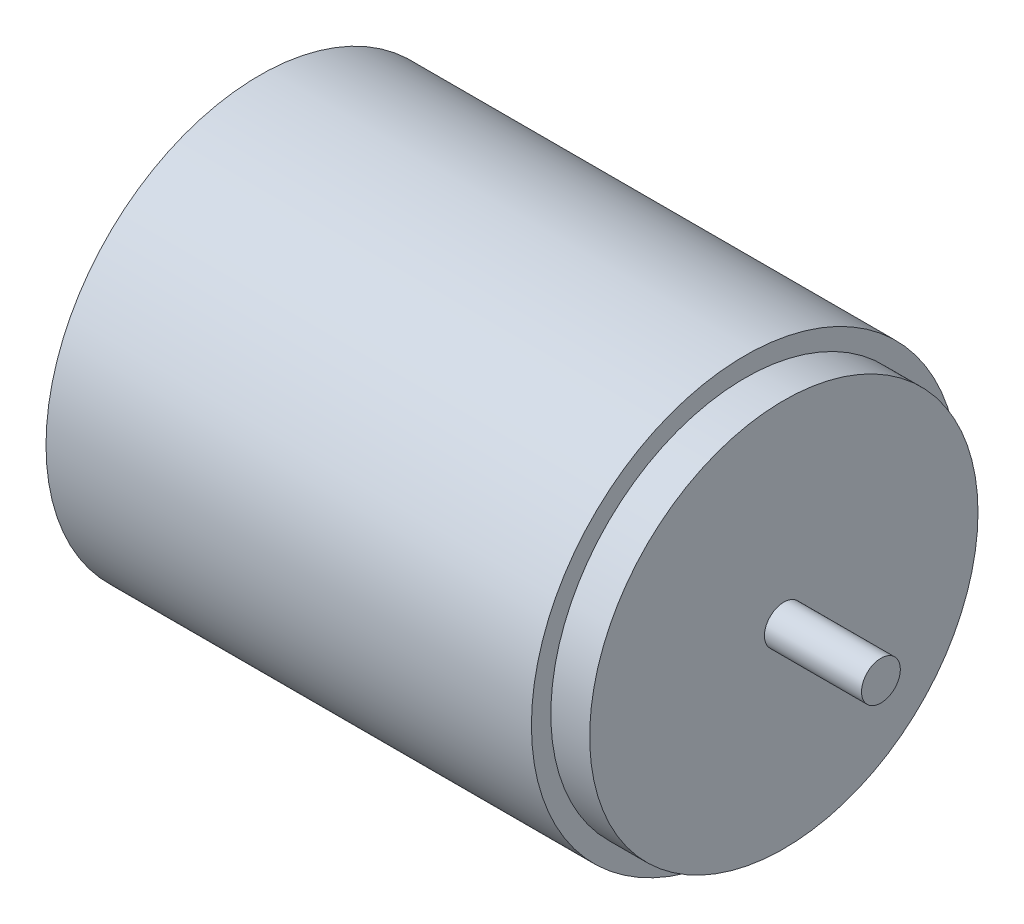
ISO-10303-21;
HEADER;
FILE_DESCRIPTION(('STEP AP214'),'2;1');
FILE_NAME('part.step','',(''),(''),'','','');
FILE_SCHEMA(('AUTOMOTIVE_DESIGN { 1 0 10303 214 1 1 1 1 }'));
ENDSEC;
DATA;
#1=APPLICATION_CONTEXT('core data for automotive mechanical design processes');
#2=APPLICATION_PROTOCOL_DEFINITION('international standard','automotive_design',2000,#1);
#3=PRODUCT_CONTEXT('',#1,'mechanical');
#4=PRODUCT('Part','Part','',(#3));
#5=PRODUCT_RELATED_PRODUCT_CATEGORY('part','',(#4));
#6=PRODUCT_DEFINITION_FORMATION('','',#4);
#7=PRODUCT_DEFINITION_CONTEXT('part definition',#1,'design');
#8=PRODUCT_DEFINITION('design','',#6,#7);
#9=PRODUCT_DEFINITION_SHAPE('','',#8);
#10=(LENGTH_UNIT() NAMED_UNIT(*) SI_UNIT(.MILLI.,.METRE.));
#11=(NAMED_UNIT(*) PLANE_ANGLE_UNIT() SI_UNIT($,.RADIAN.));
#12=(NAMED_UNIT(*) SI_UNIT($,.STERADIAN.) SOLID_ANGLE_UNIT());
#13=UNCERTAINTY_MEASURE_WITH_UNIT(LENGTH_MEASURE(1.E-05),#10,'distance_accuracy_value','');
#14=(GEOMETRIC_REPRESENTATION_CONTEXT(3) GLOBAL_UNCERTAINTY_ASSIGNED_CONTEXT((#13)) GLOBAL_UNIT_ASSIGNED_CONTEXT((#10,
#11,#12)) REPRESENTATION_CONTEXT('',''));
#15=CARTESIAN_POINT('',(0.,0.,0.));
#16=DIRECTION('',(0.,0.,1.));
#17=DIRECTION('',(1.,0.,0.));
#18=AXIS2_PLACEMENT_3D('',#15,#16,#17);
#19=CARTESIAN_POINT('',(27.,0.,0.));
#20=DIRECTION('',(1.,0.,0.));
#21=DIRECTION('',(0.,0.,-1.));
#22=AXIS2_PLACEMENT_3D('',#19,#20,#21);
#23=PLANE('',#22);
#24=CARTESIAN_POINT('',(27.,0.,0.));
#25=DIRECTION('',(1.,0.,0.));
#26=DIRECTION('',(0.,0.,-1.));
#27=AXIS2_PLACEMENT_3D('',#24,#25,#26);
#28=CIRCLE('',#27,10.);
#29=CARTESIAN_POINT('',(27.,0.,-10.));
#30=VERTEX_POINT('',#29);
#31=EDGE_CURVE('E43',#30,#30,#28,.T.);
#32=ORIENTED_EDGE('',*,*,#31,.T.);
#33=EDGE_LOOP('',(#32));
#34=FACE_BOUND('',#33,.T.);
#35=CARTESIAN_POINT('',(27.,0.,0.));
#36=DIRECTION('',(1.,0.,0.));
#37=DIRECTION('',(0.,0.,-1.));
#38=AXIS2_PLACEMENT_3D('',#35,#36,#37);
#39=CIRCLE('',#38,1.);
#40=CARTESIAN_POINT('',(27.,0.,-1.));
#41=VERTEX_POINT('',#40);
#42=EDGE_CURVE('E51',#41,#41,#39,.T.);
#43=ORIENTED_EDGE('',*,*,#42,.F.);
#44=EDGE_LOOP('',(#43));
#45=FACE_BOUND('',#44,.T.);
#46=ADVANCED_FACE('F32',(#34,#45),#23,.T.);
#47=CARTESIAN_POINT('',(25.,0.,0.));
#48=DIRECTION('',(1.,0.,0.));
#49=DIRECTION('',(0.,0.,-1.));
#50=AXIS2_PLACEMENT_3D('',#47,#48,#49);
#51=PLANE('',#50);
#52=CARTESIAN_POINT('',(25.,0.,0.));
#53=DIRECTION('',(1.,0.,0.));
#54=DIRECTION('',(0.,0.,-1.));
#55=AXIS2_PLACEMENT_3D('',#52,#53,#54);
#56=CIRCLE('',#55,11.);
#57=CARTESIAN_POINT('',(25.,0.,-11.));
#58=VERTEX_POINT('',#57);
#59=EDGE_CURVE('E10',#58,#58,#56,.T.);
#60=ORIENTED_EDGE('',*,*,#59,.T.);
#61=EDGE_LOOP('',(#60));
#62=FACE_BOUND('',#61,.T.);
#63=CARTESIAN_POINT('',(25.,0.,0.));
#64=DIRECTION('',(1.,0.,0.));
#65=DIRECTION('',(0.,0.,-1.));
#66=AXIS2_PLACEMENT_3D('',#63,#64,#65);
#67=CIRCLE('',#66,10.);
#68=CARTESIAN_POINT('',(25.,0.,-10.));
#69=VERTEX_POINT('',#68);
#70=EDGE_CURVE('E45',#69,#69,#67,.T.);
#71=ORIENTED_EDGE('',*,*,#70,.F.);
#72=EDGE_LOOP('',(#71));
#73=FACE_BOUND('',#72,.T.);
#74=ADVANCED_FACE('F67',(#62,#73),#51,.T.);
#75=CARTESIAN_POINT('',(25.,0.,0.));
#76=DIRECTION('',(-1.,0.,0.));
#77=DIRECTION('',(0.,0.,1.));
#78=AXIS2_PLACEMENT_3D('',#75,#76,#77);
#79=CYLINDRICAL_SURFACE('',#78,11.);
#80=ORIENTED_EDGE('',*,*,#59,.F.);
#81=EDGE_LOOP('',(#80));
#82=FACE_BOUND('',#81,.T.);
#83=CARTESIAN_POINT('',(0.,0.,0.));
#84=DIRECTION('',(1.,0.,0.));
#85=DIRECTION('',(0.,0.,-1.));
#86=AXIS2_PLACEMENT_3D('',#83,#84,#85);
#87=CIRCLE('',#86,11.);
#88=CARTESIAN_POINT('',(0.,0.,-11.));
#89=VERTEX_POINT('',#88);
#90=EDGE_CURVE('E36',#89,#89,#87,.T.);
#91=ORIENTED_EDGE('',*,*,#90,.T.);
#92=EDGE_LOOP('',(#91));
#93=FACE_BOUND('',#92,.T.);
#94=ADVANCED_FACE('F34',(#82,#93),#79,.T.);
#95=CARTESIAN_POINT('',(0.,0.,0.));
#96=DIRECTION('',(1.,0.,0.));
#97=DIRECTION('',(0.,0.,-1.));
#98=AXIS2_PLACEMENT_3D('',#95,#96,#97);
#99=PLANE('',#98);
#100=ORIENTED_EDGE('',*,*,#90,.F.);
#101=EDGE_LOOP('',(#100));
#102=FACE_BOUND('',#101,.T.);
#103=ADVANCED_FACE('F77',(#102),#99,.F.);
#104=CARTESIAN_POINT('',(27.,0.,0.));
#105=DIRECTION('',(-1.,0.,0.));
#106=DIRECTION('',(0.,0.,1.));
#107=AXIS2_PLACEMENT_3D('',#104,#105,#106);
#108=CYLINDRICAL_SURFACE('',#107,10.);
#109=ORIENTED_EDGE('',*,*,#31,.F.);
#110=EDGE_LOOP('',(#109));
#111=FACE_BOUND('',#110,.T.);
#112=ORIENTED_EDGE('',*,*,#70,.T.);
#113=EDGE_LOOP('',(#112));
#114=FACE_BOUND('',#113,.T.);
#115=ADVANCED_FACE('F62',(#111,#114),#108,.T.);
#116=CARTESIAN_POINT('',(32.,0.,0.));
#117=DIRECTION('',(-1.,0.,0.));
#118=DIRECTION('',(0.,0.,1.));
#119=AXIS2_PLACEMENT_3D('',#116,#117,#118);
#120=CYLINDRICAL_SURFACE('',#119,1.);
#121=CARTESIAN_POINT('',(32.,0.,0.));
#122=DIRECTION('',(1.,0.,0.));
#123=DIRECTION('',(0.,0.,-1.));
#124=AXIS2_PLACEMENT_3D('',#121,#122,#123);
#125=CIRCLE('',#124,1.);
#126=CARTESIAN_POINT('',(32.,0.,-1.));
#127=VERTEX_POINT('',#126);
#128=EDGE_CURVE('E48',#127,#127,#125,.T.);
#129=ORIENTED_EDGE('',*,*,#128,.F.);
#130=EDGE_LOOP('',(#129));
#131=FACE_BOUND('',#130,.T.);
#132=ORIENTED_EDGE('',*,*,#42,.T.);
#133=EDGE_LOOP('',(#132));
#134=FACE_BOUND('',#133,.T.);
#135=ADVANCED_FACE('F59',(#131,#134),#120,.T.);
#136=CARTESIAN_POINT('',(32.,0.,0.));
#137=DIRECTION('',(1.,0.,0.));
#138=DIRECTION('',(0.,0.,-1.));
#139=AXIS2_PLACEMENT_3D('',#136,#137,#138);
#140=PLANE('',#139);
#141=ORIENTED_EDGE('',*,*,#128,.T.);
#142=EDGE_LOOP('',(#141));
#143=FACE_BOUND('',#142,.T.);
#144=ADVANCED_FACE('F57',(#143),#140,.T.);
#145=CLOSED_SHELL('',(#46,#74,#94,#103,#115,#135,#144));
#146=MANIFOLD_SOLID_BREP('B2',#145);
#147=ADVANCED_BREP_SHAPE_REPRESENTATION('',(#18,#146),#14);
#148=SHAPE_DEFINITION_REPRESENTATION(#9,#147);
ENDSEC;
END-ISO-10303-21;
